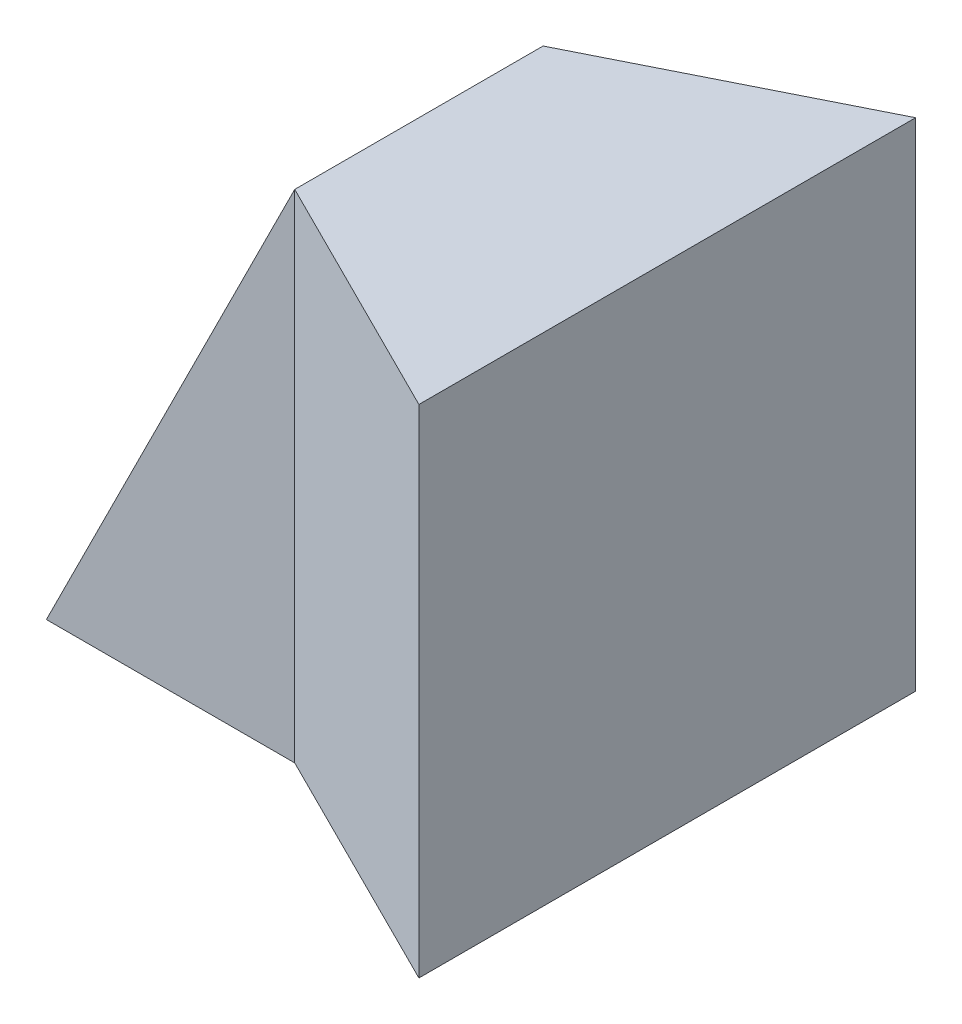
ISO-10303-21;
HEADER;
FILE_DESCRIPTION(('STEP AP214'),'2;1');
FILE_NAME('part.step','',(''),(''),'','','');
FILE_SCHEMA(('AUTOMOTIVE_DESIGN { 1 0 10303 214 1 1 1 1 }'));
ENDSEC;
DATA;
#1=APPLICATION_CONTEXT('core data for automotive mechanical design processes');
#2=APPLICATION_PROTOCOL_DEFINITION('international standard','automotive_design',2000,#1);
#3=PRODUCT_CONTEXT('',#1,'mechanical');
#4=PRODUCT('Part','Part','',(#3));
#5=PRODUCT_RELATED_PRODUCT_CATEGORY('part','',(#4));
#6=PRODUCT_DEFINITION_FORMATION('','',#4);
#7=PRODUCT_DEFINITION_CONTEXT('part definition',#1,'design');
#8=PRODUCT_DEFINITION('design','',#6,#7);
#9=PRODUCT_DEFINITION_SHAPE('','',#8);
#10=(LENGTH_UNIT() NAMED_UNIT(*) SI_UNIT(.MILLI.,.METRE.));
#11=(NAMED_UNIT(*) PLANE_ANGLE_UNIT() SI_UNIT($,.RADIAN.));
#12=(NAMED_UNIT(*) SI_UNIT($,.STERADIAN.) SOLID_ANGLE_UNIT());
#13=UNCERTAINTY_MEASURE_WITH_UNIT(LENGTH_MEASURE(1.E-05),#10,'distance_accuracy_value','');
#14=(GEOMETRIC_REPRESENTATION_CONTEXT(3) GLOBAL_UNCERTAINTY_ASSIGNED_CONTEXT((#13)) GLOBAL_UNIT_ASSIGNED_CONTEXT((#10,
#11,#12)) REPRESENTATION_CONTEXT('',''));
#15=CARTESIAN_POINT('',(0.,0.,0.));
#16=DIRECTION('',(0.,0.,1.));
#17=DIRECTION('',(1.,0.,0.));
#18=AXIS2_PLACEMENT_3D('',#15,#16,#17);
#19=CARTESIAN_POINT('',(0.,0.,40.));
#20=DIRECTION('',(0.,1.,0.));
#21=DIRECTION('',(0.,0.,1.));
#22=AXIS2_PLACEMENT_3D('',#19,#20,#21);
#23=PLANE('',#22);
#24=DIRECTION('',(0.894427190999916,0.,0.447213595499958));
#25=VECTOR('',#24,1.);
#26=CARTESIAN_POINT('',(-8.,0.,16.));
#27=LINE('',#26,#25);
#28=CARTESIAN_POINT('',(20.,0.,30.));
#29=VERTEX_POINT('',#28);
#30=CARTESIAN_POINT('',(40.,0.,40.));
#31=VERTEX_POINT('',#30);
#32=EDGE_CURVE('E55',#29,#31,#27,.T.);
#33=ORIENTED_EDGE('',*,*,#32,.F.);
#34=DIRECTION('',(1.,0.,0.));
#35=VECTOR('',#34,1.);
#36=CARTESIAN_POINT('',(0.,0.,30.));
#37=LINE('',#36,#35);
#38=CARTESIAN_POINT('',(0.,0.,30.));
#39=VERTEX_POINT('',#38);
#40=EDGE_CURVE('E83',#39,#29,#37,.T.);
#41=ORIENTED_EDGE('',*,*,#40,.F.);
#42=DIRECTION('',(0.,0.,-1.));
#43=VECTOR('',#42,1.);
#44=CARTESIAN_POINT('',(0.,0.,40.));
#45=LINE('',#44,#43);
#46=CARTESIAN_POINT('',(0.,0.,10.));
#47=VERTEX_POINT('',#46);
#48=EDGE_CURVE('E47',#39,#47,#45,.T.);
#49=ORIENTED_EDGE('',*,*,#48,.T.);
#50=DIRECTION('',(1.,0.,0.));
#51=VECTOR('',#50,1.);
#52=CARTESIAN_POINT('',(0.,0.,10.));
#53=LINE('',#52,#51);
#54=CARTESIAN_POINT('',(20.,0.,10.));
#55=VERTEX_POINT('',#54);
#56=EDGE_CURVE('E122',#47,#55,#53,.T.);
#57=ORIENTED_EDGE('',*,*,#56,.T.);
#58=DIRECTION('',(0.894427190999916,0.,-0.447213595499958));
#59=VECTOR('',#58,1.);
#60=CARTESIAN_POINT('',(8.,0.,16.));
#61=LINE('',#60,#59);
#62=CARTESIAN_POINT('',(40.,0.,0.));
#63=VERTEX_POINT('',#62);
#64=EDGE_CURVE('E84',#55,#63,#61,.T.);
#65=ORIENTED_EDGE('',*,*,#64,.T.);
#66=DIRECTION('',(0.,0.,-1.));
#67=VECTOR('',#66,1.);
#68=CARTESIAN_POINT('',(40.,0.,40.));
#69=LINE('',#68,#67);
#70=EDGE_CURVE('E115',#31,#63,#69,.T.);
#71=ORIENTED_EDGE('',*,*,#70,.F.);
#72=EDGE_LOOP('',(#33,#41,#49,#57,#65,#71));
#73=FACE_BOUND('',#72,.T.);
#74=ADVANCED_FACE('F33',(#73),#23,.F.);
#75=CARTESIAN_POINT('',(0.,40.,40.));
#76=DIRECTION('',(0.,-1.,0.));
#77=DIRECTION('',(0.,0.,-1.));
#78=AXIS2_PLACEMENT_3D('',#75,#76,#77);
#79=PLANE('',#78);
#80=DIRECTION('',(0.,0.,1.));
#81=VECTOR('',#80,1.);
#82=CARTESIAN_POINT('',(20.,40.,0.));
#83=LINE('',#82,#81);
#84=CARTESIAN_POINT('',(20.,40.,10.));
#85=VERTEX_POINT('',#84);
#86=CARTESIAN_POINT('',(20.,40.,30.));
#87=VERTEX_POINT('',#86);
#88=EDGE_CURVE('E100',#85,#87,#83,.T.);
#89=ORIENTED_EDGE('',*,*,#88,.T.);
#90=DIRECTION('',(0.894427190999916,0.,0.447213595499958));
#91=VECTOR('',#90,1.);
#92=CARTESIAN_POINT('',(-8.,40.,16.));
#93=LINE('',#92,#91);
#94=CARTESIAN_POINT('',(40.,40.,40.));
#95=VERTEX_POINT('',#94);
#96=EDGE_CURVE('E85',#87,#95,#93,.T.);
#97=ORIENTED_EDGE('',*,*,#96,.T.);
#98=DIRECTION('',(0.,0.,-1.));
#99=VECTOR('',#98,1.);
#100=CARTESIAN_POINT('',(40.,40.,40.));
#101=LINE('',#100,#99);
#102=CARTESIAN_POINT('',(40.,40.,0.));
#103=VERTEX_POINT('',#102);
#104=EDGE_CURVE('E112',#95,#103,#101,.T.);
#105=ORIENTED_EDGE('',*,*,#104,.T.);
#106=DIRECTION('',(0.894427190999916,0.,-0.447213595499958));
#107=VECTOR('',#106,1.);
#108=CARTESIAN_POINT('',(8.,40.,16.));
#109=LINE('',#108,#107);
#110=EDGE_CURVE('E103',#85,#103,#109,.T.);
#111=ORIENTED_EDGE('',*,*,#110,.F.);
#112=EDGE_LOOP('',(#89,#97,#105,#111));
#113=FACE_BOUND('',#112,.T.);
#114=ADVANCED_FACE('F102',(#113),#79,.F.);
#115=CARTESIAN_POINT('',(20.,40.,0.));
#116=DIRECTION('',(0.894427190999916,-0.447213595499958,0.));
#117=DIRECTION('',(0.447213595499958,0.894427190999916,0.));
#118=AXIS2_PLACEMENT_3D('',#115,#116,#117);
#119=PLANE('',#118);
#120=ORIENTED_EDGE('',*,*,#48,.F.);
#121=DIRECTION('',(0.447213595499958,0.894427190999916,0.));
#122=VECTOR('',#121,1.);
#123=CARTESIAN_POINT('',(20.,40.,30.));
#124=LINE('',#123,#122);
#125=EDGE_CURVE('E11',#39,#87,#124,.T.);
#126=ORIENTED_EDGE('',*,*,#125,.T.);
#127=ORIENTED_EDGE('',*,*,#88,.F.);
#128=DIRECTION('',(0.447213595499958,0.894427190999916,0.));
#129=VECTOR('',#128,1.);
#130=CARTESIAN_POINT('',(20.,40.,10.));
#131=LINE('',#130,#129);
#132=EDGE_CURVE('E40',#47,#85,#131,.T.);
#133=ORIENTED_EDGE('',*,*,#132,.F.);
#134=EDGE_LOOP('',(#120,#126,#127,#133));
#135=FACE_BOUND('',#134,.T.);
#136=ADVANCED_FACE('F98',(#135),#119,.F.);
#137=CARTESIAN_POINT('',(40.,0.,40.));
#138=DIRECTION('',(-1.,0.,0.));
#139=DIRECTION('',(0.,0.,1.));
#140=AXIS2_PLACEMENT_3D('',#137,#138,#139);
#141=PLANE('',#140);
#142=DIRECTION('',(0.,1.,0.));
#143=VECTOR('',#142,1.);
#144=CARTESIAN_POINT('',(40.,0.,0.));
#145=LINE('',#144,#143);
#146=EDGE_CURVE('E104',#63,#103,#145,.T.);
#147=ORIENTED_EDGE('',*,*,#146,.T.);
#148=ORIENTED_EDGE('',*,*,#104,.F.);
#149=DIRECTION('',(0.,1.,0.));
#150=VECTOR('',#149,1.);
#151=CARTESIAN_POINT('',(40.,0.,40.));
#152=LINE('',#151,#150);
#153=EDGE_CURVE('E90',#31,#95,#152,.T.);
#154=ORIENTED_EDGE('',*,*,#153,.F.);
#155=ORIENTED_EDGE('',*,*,#70,.T.);
#156=EDGE_LOOP('',(#147,#148,#154,#155));
#157=FACE_BOUND('',#156,.T.);
#158=ADVANCED_FACE('F138',(#157),#141,.F.);
#159=CARTESIAN_POINT('',(0.,40.,10.));
#160=DIRECTION('',(0.,0.,-1.));
#161=DIRECTION('',(-1.,0.,0.));
#162=AXIS2_PLACEMENT_3D('',#159,#160,#161);
#163=PLANE('',#162);
#164=ORIENTED_EDGE('',*,*,#132,.T.);
#165=DIRECTION('',(0.,-1.,0.));
#166=VECTOR('',#165,1.);
#167=CARTESIAN_POINT('',(20.,40.,10.));
#168=LINE('',#167,#166);
#169=EDGE_CURVE('E105',#85,#55,#168,.T.);
#170=ORIENTED_EDGE('',*,*,#169,.T.);
#171=ORIENTED_EDGE('',*,*,#56,.F.);
#172=EDGE_LOOP('',(#164,#170,#171));
#173=FACE_BOUND('',#172,.T.);
#174=ADVANCED_FACE('F120',(#173),#163,.T.);
#175=CARTESIAN_POINT('',(8.,40.,16.));
#176=DIRECTION('',(-0.447213595499958,0.,-0.894427190999916));
#177=DIRECTION('',(-0.894427190999916,0.,0.447213595499958));
#178=AXIS2_PLACEMENT_3D('',#175,#176,#177);
#179=PLANE('',#178);
#180=ORIENTED_EDGE('',*,*,#64,.F.);
#181=ORIENTED_EDGE('',*,*,#169,.F.);
#182=ORIENTED_EDGE('',*,*,#110,.T.);
#183=ORIENTED_EDGE('',*,*,#146,.F.);
#184=EDGE_LOOP('',(#180,#181,#182,#183));
#185=FACE_BOUND('',#184,.T.);
#186=ADVANCED_FACE('F124',(#185),#179,.T.);
#187=CARTESIAN_POINT('',(0.,40.,30.));
#188=DIRECTION('',(0.,0.,-1.));
#189=DIRECTION('',(-1.,0.,0.));
#190=AXIS2_PLACEMENT_3D('',#187,#188,#189);
#191=PLANE('',#190);
#192=ORIENTED_EDGE('',*,*,#40,.T.);
#193=DIRECTION('',(0.,-1.,0.));
#194=VECTOR('',#193,1.);
#195=CARTESIAN_POINT('',(20.,40.,30.));
#196=LINE('',#195,#194);
#197=EDGE_CURVE('E80',#87,#29,#196,.T.);
#198=ORIENTED_EDGE('',*,*,#197,.F.);
#199=ORIENTED_EDGE('',*,*,#125,.F.);
#200=EDGE_LOOP('',(#192,#198,#199));
#201=FACE_BOUND('',#200,.T.);
#202=ADVANCED_FACE('F82',(#201),#191,.F.);
#203=CARTESIAN_POINT('',(-8.,40.,16.));
#204=DIRECTION('',(0.447213595499958,0.,-0.894427190999916));
#205=DIRECTION('',(-0.894427190999916,0.,-0.447213595499958));
#206=AXIS2_PLACEMENT_3D('',#203,#204,#205);
#207=PLANE('',#206);
#208=ORIENTED_EDGE('',*,*,#32,.T.);
#209=ORIENTED_EDGE('',*,*,#153,.T.);
#210=ORIENTED_EDGE('',*,*,#96,.F.);
#211=ORIENTED_EDGE('',*,*,#197,.T.);
#212=EDGE_LOOP('',(#208,#209,#210,#211));
#213=FACE_BOUND('',#212,.T.);
#214=ADVANCED_FACE('F88',(#213),#207,.F.);
#215=CLOSED_SHELL('',(#74,#114,#136,#158,#174,#186,#202,#214));
#216=MANIFOLD_SOLID_BREP('B2',#215);
#217=ADVANCED_BREP_SHAPE_REPRESENTATION('',(#18,#216),#14);
#218=SHAPE_DEFINITION_REPRESENTATION(#9,#217);
ENDSEC;
END-ISO-10303-21;
